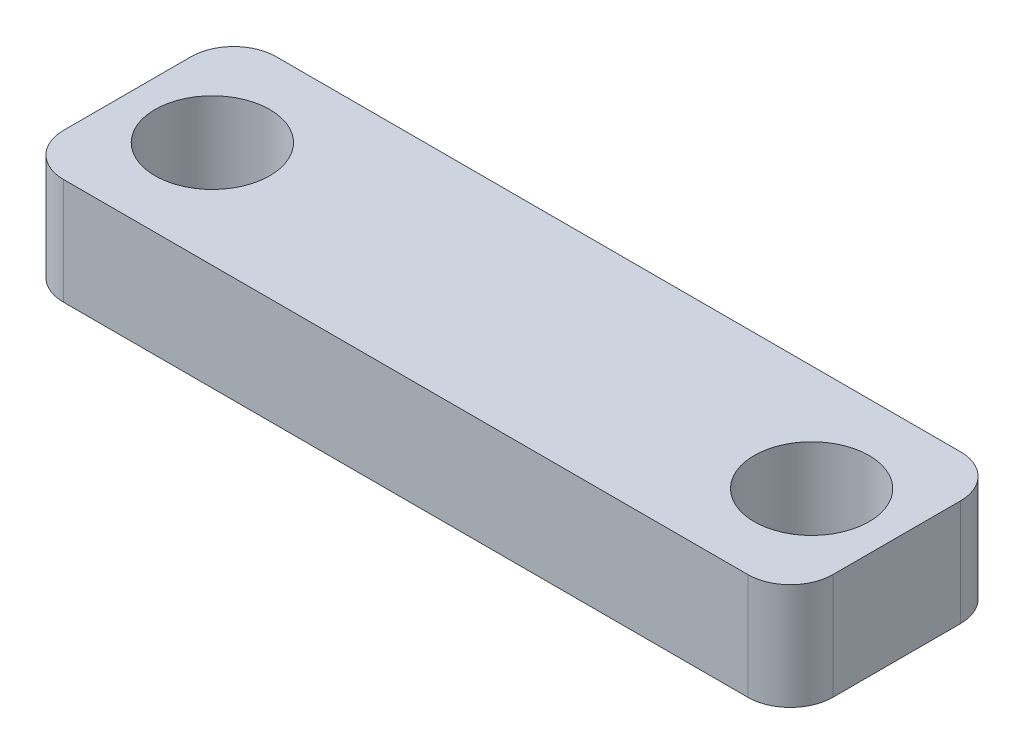
ISO-10303-21;
HEADER;
FILE_DESCRIPTION(('STEP AP214'),'2;1');
FILE_NAME('part.step','',(''),(''),'','','');
FILE_SCHEMA(('AUTOMOTIVE_DESIGN { 1 0 10303 214 1 1 1 1 }'));
ENDSEC;
DATA;
#1=APPLICATION_CONTEXT('core data for automotive mechanical design processes');
#2=APPLICATION_PROTOCOL_DEFINITION('international standard','automotive_design',2000,#1);
#3=PRODUCT_CONTEXT('',#1,'mechanical');
#4=PRODUCT('Part','Part','',(#3));
#5=PRODUCT_RELATED_PRODUCT_CATEGORY('part','',(#4));
#6=PRODUCT_DEFINITION_FORMATION('','',#4);
#7=PRODUCT_DEFINITION_CONTEXT('part definition',#1,'design');
#8=PRODUCT_DEFINITION('design','',#6,#7);
#9=PRODUCT_DEFINITION_SHAPE('','',#8);
#10=(LENGTH_UNIT() NAMED_UNIT(*) SI_UNIT(.MILLI.,.METRE.));
#11=(NAMED_UNIT(*) PLANE_ANGLE_UNIT() SI_UNIT($,.RADIAN.));
#12=(NAMED_UNIT(*) SI_UNIT($,.STERADIAN.) SOLID_ANGLE_UNIT());
#13=UNCERTAINTY_MEASURE_WITH_UNIT(LENGTH_MEASURE(1.E-05),#10,'distance_accuracy_value','');
#14=(GEOMETRIC_REPRESENTATION_CONTEXT(3) GLOBAL_UNCERTAINTY_ASSIGNED_CONTEXT((#13)) GLOBAL_UNIT_ASSIGNED_CONTEXT((#10,
#11,#12)) REPRESENTATION_CONTEXT('',''));
#15=CARTESIAN_POINT('',(0.,0.,0.));
#16=DIRECTION('',(0.,0.,1.));
#17=DIRECTION('',(1.,0.,0.));
#18=AXIS2_PLACEMENT_3D('',#15,#16,#17);
#19=CARTESIAN_POINT('',(9.045,2.5,2.5));
#20=DIRECTION('',(-1.,0.,0.));
#21=DIRECTION('',(0.,0.,1.));
#22=AXIS2_PLACEMENT_3D('',#19,#20,#21);
#23=PLANE('',#22);
#24=DIRECTION('',(0.,0.,-1.));
#25=VECTOR('',#24,1.);
#26=CARTESIAN_POINT('',(9.045,2.5,2.5));
#27=LINE('',#26,#25);
#28=CARTESIAN_POINT('',(9.045,2.5,1.5));
#29=VERTEX_POINT('',#28);
#30=CARTESIAN_POINT('',(9.045,2.5,-1.5));
#31=VERTEX_POINT('',#30);
#32=EDGE_CURVE('E132',#29,#31,#27,.T.);
#33=ORIENTED_EDGE('',*,*,#32,.F.);
#34=DIRECTION('',(0.,-1.,0.));
#35=VECTOR('',#34,1.);
#36=CARTESIAN_POINT('',(9.045,2.5,1.5));
#37=LINE('',#36,#35);
#38=CARTESIAN_POINT('',(9.045,0.,1.5));
#39=VERTEX_POINT('',#38);
#40=EDGE_CURVE('E158',#29,#39,#37,.T.);
#41=ORIENTED_EDGE('',*,*,#40,.T.);
#42=DIRECTION('',(0.,0.,-1.));
#43=VECTOR('',#42,1.);
#44=CARTESIAN_POINT('',(9.045,0.,2.5));
#45=LINE('',#44,#43);
#46=CARTESIAN_POINT('',(9.045,0.,-1.5));
#47=VERTEX_POINT('',#46);
#48=EDGE_CURVE('E166',#39,#47,#45,.T.);
#49=ORIENTED_EDGE('',*,*,#48,.T.);
#50=DIRECTION('',(0.,-1.,0.));
#51=VECTOR('',#50,1.);
#52=CARTESIAN_POINT('',(9.045,2.5,-1.5));
#53=LINE('',#52,#51);
#54=EDGE_CURVE('E156',#47,#31,#53,.F.);
#55=ORIENTED_EDGE('',*,*,#54,.T.);
#56=EDGE_LOOP('',(#33,#41,#49,#55));
#57=FACE_BOUND('',#56,.T.);
#58=ADVANCED_FACE('F41',(#57),#23,.F.);
#59=CARTESIAN_POINT('',(-9.045,2.5,-2.5));
#60=DIRECTION('',(0.,0.,1.));
#61=DIRECTION('',(1.,0.,0.));
#62=AXIS2_PLACEMENT_3D('',#59,#60,#61);
#63=PLANE('',#62);
#64=DIRECTION('',(-1.,0.,0.));
#65=VECTOR('',#64,1.);
#66=CARTESIAN_POINT('',(-9.045,0.,-2.5));
#67=LINE('',#66,#65);
#68=CARTESIAN_POINT('',(8.045,0.,-2.5));
#69=VERTEX_POINT('',#68);
#70=CARTESIAN_POINT('',(-8.045,0.,-2.5));
#71=VERTEX_POINT('',#70);
#72=EDGE_CURVE('E137',#69,#71,#67,.T.);
#73=ORIENTED_EDGE('',*,*,#72,.T.);
#74=DIRECTION('',(0.,-1.,0.));
#75=VECTOR('',#74,1.);
#76=CARTESIAN_POINT('',(-8.045,2.5,-2.5));
#77=LINE('',#76,#75);
#78=CARTESIAN_POINT('',(-8.045,2.5,-2.5));
#79=VERTEX_POINT('',#78);
#80=EDGE_CURVE('E11',#71,#79,#77,.F.);
#81=ORIENTED_EDGE('',*,*,#80,.T.);
#82=DIRECTION('',(-1.,0.,0.));
#83=VECTOR('',#82,1.);
#84=CARTESIAN_POINT('',(-9.045,2.5,-2.5));
#85=LINE('',#84,#83);
#86=CARTESIAN_POINT('',(8.045,2.5,-2.5));
#87=VERTEX_POINT('',#86);
#88=EDGE_CURVE('E135',#87,#79,#85,.T.);
#89=ORIENTED_EDGE('',*,*,#88,.F.);
#90=DIRECTION('',(0.,-1.,0.));
#91=VECTOR('',#90,1.);
#92=CARTESIAN_POINT('',(8.045,2.5,-2.5));
#93=LINE('',#92,#91);
#94=EDGE_CURVE('E49',#87,#69,#93,.T.);
#95=ORIENTED_EDGE('',*,*,#94,.T.);
#96=EDGE_LOOP('',(#73,#81,#89,#95));
#97=FACE_BOUND('',#96,.T.);
#98=ADVANCED_FACE('F163',(#97),#63,.F.);
#99=CARTESIAN_POINT('',(-9.045,2.5,2.5));
#100=DIRECTION('',(1.,0.,0.));
#101=DIRECTION('',(0.,0.,-1.));
#102=AXIS2_PLACEMENT_3D('',#99,#100,#101);
#103=PLANE('',#102);
#104=DIRECTION('',(0.,0.,1.));
#105=VECTOR('',#104,1.);
#106=CARTESIAN_POINT('',(-9.045,0.,2.5));
#107=LINE('',#106,#105);
#108=CARTESIAN_POINT('',(-9.045,0.,-1.5));
#109=VERTEX_POINT('',#108);
#110=CARTESIAN_POINT('',(-9.045,0.,1.5));
#111=VERTEX_POINT('',#110);
#112=EDGE_CURVE('E133',#109,#111,#107,.T.);
#113=ORIENTED_EDGE('',*,*,#112,.T.);
#114=DIRECTION('',(0.,-1.,0.));
#115=VECTOR('',#114,1.);
#116=CARTESIAN_POINT('',(-9.045,2.5,1.5));
#117=LINE('',#116,#115);
#118=CARTESIAN_POINT('',(-9.045,2.5,1.5));
#119=VERTEX_POINT('',#118);
#120=EDGE_CURVE('E111',#111,#119,#117,.F.);
#121=ORIENTED_EDGE('',*,*,#120,.T.);
#122=DIRECTION('',(0.,0.,1.));
#123=VECTOR('',#122,1.);
#124=CARTESIAN_POINT('',(-9.045,2.5,2.5));
#125=LINE('',#124,#123);
#126=CARTESIAN_POINT('',(-9.045,2.5,-1.5));
#127=VERTEX_POINT('',#126);
#128=EDGE_CURVE('E171',#127,#119,#125,.T.);
#129=ORIENTED_EDGE('',*,*,#128,.F.);
#130=DIRECTION('',(0.,-1.,0.));
#131=VECTOR('',#130,1.);
#132=CARTESIAN_POINT('',(-9.045,2.5,-1.5));
#133=LINE('',#132,#131);
#134=EDGE_CURVE('E116',#127,#109,#133,.T.);
#135=ORIENTED_EDGE('',*,*,#134,.T.);
#136=EDGE_LOOP('',(#113,#121,#129,#135));
#137=FACE_BOUND('',#136,.T.);
#138=ADVANCED_FACE('F212',(#137),#103,.F.);
#139=CARTESIAN_POINT('',(-9.045,2.5,2.5));
#140=DIRECTION('',(0.,0.,-1.));
#141=DIRECTION('',(-1.,0.,0.));
#142=AXIS2_PLACEMENT_3D('',#139,#140,#141);
#143=PLANE('',#142);
#144=DIRECTION('',(1.,0.,0.));
#145=VECTOR('',#144,1.);
#146=CARTESIAN_POINT('',(-9.045,2.5,2.5));
#147=LINE('',#146,#145);
#148=CARTESIAN_POINT('',(-8.045,2.5,2.5));
#149=VERTEX_POINT('',#148);
#150=CARTESIAN_POINT('',(8.045,2.5,2.5));
#151=VERTEX_POINT('',#150);
#152=EDGE_CURVE('E126',#149,#151,#147,.T.);
#153=ORIENTED_EDGE('',*,*,#152,.F.);
#154=DIRECTION('',(0.,-1.,0.));
#155=VECTOR('',#154,1.);
#156=CARTESIAN_POINT('',(-8.045,2.5,2.5));
#157=LINE('',#156,#155);
#158=CARTESIAN_POINT('',(-8.045,0.,2.5));
#159=VERTEX_POINT('',#158);
#160=EDGE_CURVE('E110',#149,#159,#157,.T.);
#161=ORIENTED_EDGE('',*,*,#160,.T.);
#162=DIRECTION('',(1.,0.,0.));
#163=VECTOR('',#162,1.);
#164=CARTESIAN_POINT('',(-9.045,0.,2.5));
#165=LINE('',#164,#163);
#166=CARTESIAN_POINT('',(8.045,0.,2.5));
#167=VERTEX_POINT('',#166);
#168=EDGE_CURVE('E123',#159,#167,#165,.T.);
#169=ORIENTED_EDGE('',*,*,#168,.T.);
#170=DIRECTION('',(0.,-1.,0.));
#171=VECTOR('',#170,1.);
#172=CARTESIAN_POINT('',(8.045,2.5,2.5));
#173=LINE('',#172,#171);
#174=EDGE_CURVE('E128',#167,#151,#173,.F.);
#175=ORIENTED_EDGE('',*,*,#174,.T.);
#176=EDGE_LOOP('',(#153,#161,#169,#175));
#177=FACE_BOUND('',#176,.T.);
#178=ADVANCED_FACE('F122',(#177),#143,.F.);
#179=CARTESIAN_POINT('',(0.,2.5,0.));
#180=DIRECTION('',(0.,-1.,0.));
#181=DIRECTION('',(0.,0.,-1.));
#182=AXIS2_PLACEMENT_3D('',#179,#180,#181);
#183=PLANE('',#182);
#184=CARTESIAN_POINT('',(7.045,2.5,0.));
#185=DIRECTION('',(0.,-1.,0.));
#186=DIRECTION('',(0.,0.,-1.));
#187=AXIS2_PLACEMENT_3D('',#184,#185,#186);
#188=CIRCLE('',#187,1.35);
#189=CARTESIAN_POINT('',(7.045,2.5,-1.35));
#190=VERTEX_POINT('',#189);
#191=EDGE_CURVE('E180',#190,#190,#188,.T.);
#192=ORIENTED_EDGE('',*,*,#191,.T.);
#193=EDGE_LOOP('',(#192));
#194=FACE_BOUND('',#193,.T.);
#195=CARTESIAN_POINT('',(-7.045,2.5,0.));
#196=DIRECTION('',(0.,-1.,0.));
#197=DIRECTION('',(0.,0.,-1.));
#198=AXIS2_PLACEMENT_3D('',#195,#196,#197);
#199=CIRCLE('',#198,1.35);
#200=CARTESIAN_POINT('',(-7.045,2.5,-1.35));
#201=VERTEX_POINT('',#200);
#202=EDGE_CURVE('E167',#201,#201,#199,.T.);
#203=ORIENTED_EDGE('',*,*,#202,.T.);
#204=EDGE_LOOP('',(#203));
#205=FACE_BOUND('',#204,.T.);
#206=ORIENTED_EDGE('',*,*,#128,.T.);
#207=CARTESIAN_POINT('',(-8.045,2.5,1.5));
#208=DIRECTION('',(0.,-1.,0.));
#209=DIRECTION('',(0.,0.,-1.));
#210=AXIS2_PLACEMENT_3D('',#207,#208,#209);
#211=CIRCLE('',#210,1.);
#212=EDGE_CURVE('E154',#119,#149,#211,.F.);
#213=ORIENTED_EDGE('',*,*,#212,.T.);
#214=ORIENTED_EDGE('',*,*,#152,.T.);
#215=CARTESIAN_POINT('',(8.045,2.5,1.5));
#216=DIRECTION('',(0.,-1.,0.));
#217=DIRECTION('',(0.,0.,-1.));
#218=AXIS2_PLACEMENT_3D('',#215,#216,#217);
#219=CIRCLE('',#218,1.);
#220=EDGE_CURVE('E152',#151,#29,#219,.F.);
#221=ORIENTED_EDGE('',*,*,#220,.T.);
#222=ORIENTED_EDGE('',*,*,#32,.T.);
#223=CARTESIAN_POINT('',(8.045,2.5,-1.5));
#224=DIRECTION('',(0.,-1.,0.));
#225=DIRECTION('',(0.,0.,-1.));
#226=AXIS2_PLACEMENT_3D('',#223,#224,#225);
#227=CIRCLE('',#226,1.);
#228=EDGE_CURVE('E61',#31,#87,#227,.F.);
#229=ORIENTED_EDGE('',*,*,#228,.T.);
#230=ORIENTED_EDGE('',*,*,#88,.T.);
#231=CARTESIAN_POINT('',(-8.045,2.5,-1.5));
#232=DIRECTION('',(0.,-1.,0.));
#233=DIRECTION('',(0.,0.,-1.));
#234=AXIS2_PLACEMENT_3D('',#231,#232,#233);
#235=CIRCLE('',#234,1.);
#236=EDGE_CURVE('E150',#79,#127,#235,.F.);
#237=ORIENTED_EDGE('',*,*,#236,.T.);
#238=EDGE_LOOP('',(#206,#213,#214,#221,#222,#229,#230,#237));
#239=FACE_BOUND('',#238,.T.);
#240=ADVANCED_FACE('F192',(#194,#205,#239),#183,.F.);
#241=CARTESIAN_POINT('',(0.,0.,0.));
#242=DIRECTION('',(0.,-1.,0.));
#243=DIRECTION('',(0.,0.,-1.));
#244=AXIS2_PLACEMENT_3D('',#241,#242,#243);
#245=PLANE('',#244);
#246=CARTESIAN_POINT('',(7.045,0.,0.));
#247=DIRECTION('',(0.,-1.,0.));
#248=DIRECTION('',(0.,0.,-1.));
#249=AXIS2_PLACEMENT_3D('',#246,#247,#248);
#250=CIRCLE('',#249,1.35);
#251=CARTESIAN_POINT('',(7.045,0.,-1.35));
#252=VERTEX_POINT('',#251);
#253=EDGE_CURVE('E183',#252,#252,#250,.T.);
#254=ORIENTED_EDGE('',*,*,#253,.F.);
#255=EDGE_LOOP('',(#254));
#256=FACE_BOUND('',#255,.T.);
#257=CARTESIAN_POINT('',(-7.045,0.,0.));
#258=DIRECTION('',(0.,-1.,0.));
#259=DIRECTION('',(0.,0.,-1.));
#260=AXIS2_PLACEMENT_3D('',#257,#258,#259);
#261=CIRCLE('',#260,1.35);
#262=CARTESIAN_POINT('',(-7.045,0.,-1.35));
#263=VERTEX_POINT('',#262);
#264=EDGE_CURVE('E177',#263,#263,#261,.T.);
#265=ORIENTED_EDGE('',*,*,#264,.F.);
#266=EDGE_LOOP('',(#265));
#267=FACE_BOUND('',#266,.T.);
#268=ORIENTED_EDGE('',*,*,#168,.F.);
#269=CARTESIAN_POINT('',(-8.045,0.,1.5));
#270=DIRECTION('',(0.,-1.,0.));
#271=DIRECTION('',(0.,0.,-1.));
#272=AXIS2_PLACEMENT_3D('',#269,#270,#271);
#273=CIRCLE('',#272,1.);
#274=EDGE_CURVE('E106',#159,#111,#273,.T.);
#275=ORIENTED_EDGE('',*,*,#274,.T.);
#276=ORIENTED_EDGE('',*,*,#112,.F.);
#277=CARTESIAN_POINT('',(-8.045,0.,-1.5));
#278=DIRECTION('',(0.,-1.,0.));
#279=DIRECTION('',(0.,0.,-1.));
#280=AXIS2_PLACEMENT_3D('',#277,#278,#279);
#281=CIRCLE('',#280,1.);
#282=EDGE_CURVE('E143',#109,#71,#281,.T.);
#283=ORIENTED_EDGE('',*,*,#282,.T.);
#284=ORIENTED_EDGE('',*,*,#72,.F.);
#285=CARTESIAN_POINT('',(8.045,0.,-1.5));
#286=DIRECTION('',(0.,-1.,0.));
#287=DIRECTION('',(0.,0.,-1.));
#288=AXIS2_PLACEMENT_3D('',#285,#286,#287);
#289=CIRCLE('',#288,1.);
#290=EDGE_CURVE('E127',#69,#47,#289,.T.);
#291=ORIENTED_EDGE('',*,*,#290,.T.);
#292=ORIENTED_EDGE('',*,*,#48,.F.);
#293=CARTESIAN_POINT('',(8.045,0.,1.5));
#294=DIRECTION('',(0.,-1.,0.));
#295=DIRECTION('',(0.,0.,-1.));
#296=AXIS2_PLACEMENT_3D('',#293,#294,#295);
#297=CIRCLE('',#296,1.);
#298=EDGE_CURVE('E117',#39,#167,#297,.T.);
#299=ORIENTED_EDGE('',*,*,#298,.T.);
#300=EDGE_LOOP('',(#268,#275,#276,#283,#284,#291,#292,#299));
#301=FACE_BOUND('',#300,.T.);
#302=ADVANCED_FACE('F130',(#256,#267,#301),#245,.T.);
#303=CARTESIAN_POINT('',(-7.045,0.,0.));
#304=DIRECTION('',(0.,-1.,0.));
#305=DIRECTION('',(0.,0.,-1.));
#306=AXIS2_PLACEMENT_3D('',#303,#304,#305);
#307=CYLINDRICAL_SURFACE('',#306,1.35);
#308=ORIENTED_EDGE('',*,*,#202,.F.);
#309=EDGE_LOOP('',(#308));
#310=FACE_BOUND('',#309,.T.);
#311=ORIENTED_EDGE('',*,*,#264,.T.);
#312=EDGE_LOOP('',(#311));
#313=FACE_BOUND('',#312,.T.);
#314=ADVANCED_FACE('F191',(#310,#313),#307,.F.);
#315=CARTESIAN_POINT('',(7.045,0.,0.));
#316=DIRECTION('',(0.,-1.,0.));
#317=DIRECTION('',(0.,0.,-1.));
#318=AXIS2_PLACEMENT_3D('',#315,#316,#317);
#319=CYLINDRICAL_SURFACE('',#318,1.35);
#320=ORIENTED_EDGE('',*,*,#191,.F.);
#321=EDGE_LOOP('',(#320));
#322=FACE_BOUND('',#321,.T.);
#323=ORIENTED_EDGE('',*,*,#253,.T.);
#324=EDGE_LOOP('',(#323));
#325=FACE_BOUND('',#324,.T.);
#326=ADVANCED_FACE('F187',(#322,#325),#319,.F.);
#327=CARTESIAN_POINT('',(-8.045,2.5,1.5));
#328=DIRECTION('',(0.,-1.,0.));
#329=DIRECTION('',(0.,0.,-1.));
#330=AXIS2_PLACEMENT_3D('',#327,#328,#329);
#331=CYLINDRICAL_SURFACE('',#330,1.);
#332=ORIENTED_EDGE('',*,*,#212,.F.);
#333=ORIENTED_EDGE('',*,*,#120,.F.);
#334=ORIENTED_EDGE('',*,*,#274,.F.);
#335=ORIENTED_EDGE('',*,*,#160,.F.);
#336=EDGE_LOOP('',(#332,#333,#334,#335));
#337=FACE_BOUND('',#336,.T.);
#338=ADVANCED_FACE('F109',(#337),#331,.T.);
#339=CARTESIAN_POINT('',(8.045,2.5,1.5));
#340=DIRECTION('',(0.,-1.,0.));
#341=DIRECTION('',(0.,0.,-1.));
#342=AXIS2_PLACEMENT_3D('',#339,#340,#341);
#343=CYLINDRICAL_SURFACE('',#342,1.);
#344=ORIENTED_EDGE('',*,*,#220,.F.);
#345=ORIENTED_EDGE('',*,*,#174,.F.);
#346=ORIENTED_EDGE('',*,*,#298,.F.);
#347=ORIENTED_EDGE('',*,*,#40,.F.);
#348=EDGE_LOOP('',(#344,#345,#346,#347));
#349=FACE_BOUND('',#348,.T.);
#350=ADVANCED_FACE('F219',(#349),#343,.T.);
#351=CARTESIAN_POINT('',(-8.045,2.5,-1.5));
#352=DIRECTION('',(0.,-1.,0.));
#353=DIRECTION('',(0.,0.,-1.));
#354=AXIS2_PLACEMENT_3D('',#351,#352,#353);
#355=CYLINDRICAL_SURFACE('',#354,1.);
#356=ORIENTED_EDGE('',*,*,#236,.F.);
#357=ORIENTED_EDGE('',*,*,#80,.F.);
#358=ORIENTED_EDGE('',*,*,#282,.F.);
#359=ORIENTED_EDGE('',*,*,#134,.F.);
#360=EDGE_LOOP('',(#356,#357,#358,#359));
#361=FACE_BOUND('',#360,.T.);
#362=ADVANCED_FACE('F221',(#361),#355,.T.);
#363=CARTESIAN_POINT('',(8.045,2.5,-1.5));
#364=DIRECTION('',(0.,-1.,0.));
#365=DIRECTION('',(0.,0.,-1.));
#366=AXIS2_PLACEMENT_3D('',#363,#364,#365);
#367=CYLINDRICAL_SURFACE('',#366,1.);
#368=ORIENTED_EDGE('',*,*,#228,.F.);
#369=ORIENTED_EDGE('',*,*,#54,.F.);
#370=ORIENTED_EDGE('',*,*,#290,.F.);
#371=ORIENTED_EDGE('',*,*,#94,.F.);
#372=EDGE_LOOP('',(#368,#369,#370,#371));
#373=FACE_BOUND('',#372,.T.);
#374=ADVANCED_FACE('F43',(#373),#367,.T.);
#375=CLOSED_SHELL('',(#58,#98,#138,#178,#240,#302,#314,#326,#338,#350,#362,#374));
#376=MANIFOLD_SOLID_BREP('B2',#375);
#377=ADVANCED_BREP_SHAPE_REPRESENTATION('',(#18,#376),#14);
#378=SHAPE_DEFINITION_REPRESENTATION(#9,#377);
ENDSEC;
END-ISO-10303-21;
